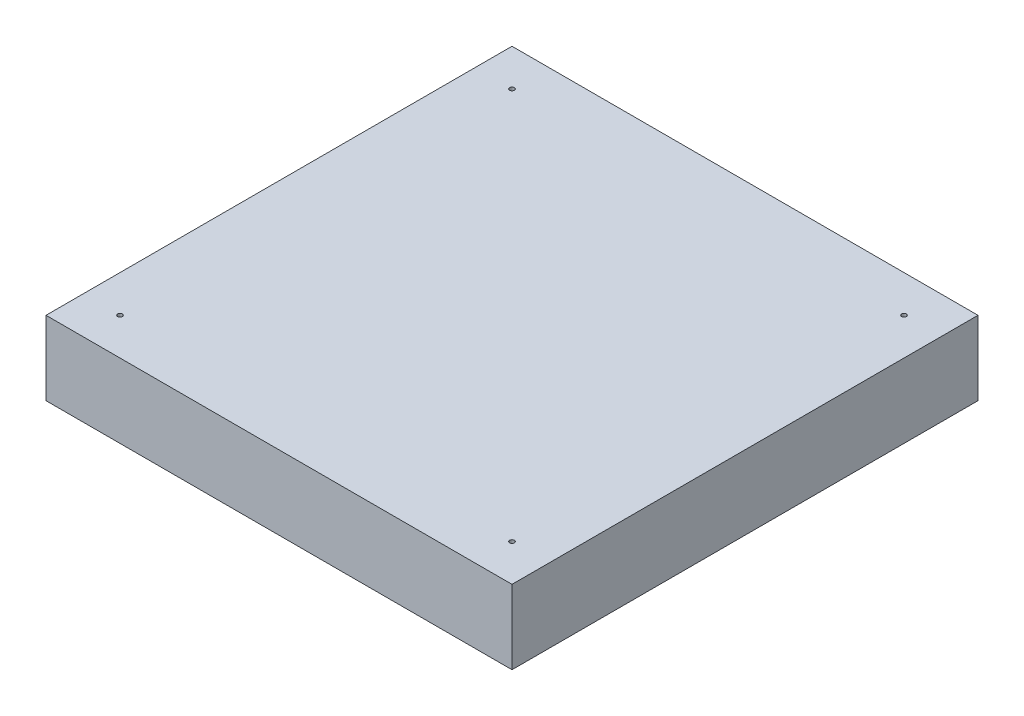
ISO-10303-21;
HEADER;
FILE_DESCRIPTION(('STEP AP214'),'2;1');
FILE_NAME('part.step','',(''),(''),'','','');
FILE_SCHEMA(('AUTOMOTIVE_DESIGN { 1 0 10303 214 1 1 1 1 }'));
ENDSEC;
DATA;
#1=APPLICATION_CONTEXT('core data for automotive mechanical design processes');
#2=APPLICATION_PROTOCOL_DEFINITION('international standard','automotive_design',2000,#1);
#3=PRODUCT_CONTEXT('',#1,'mechanical');
#4=PRODUCT('Part','Part','',(#3));
#5=PRODUCT_RELATED_PRODUCT_CATEGORY('part','',(#4));
#6=PRODUCT_DEFINITION_FORMATION('','',#4);
#7=PRODUCT_DEFINITION_CONTEXT('part definition',#1,'design');
#8=PRODUCT_DEFINITION('design','',#6,#7);
#9=PRODUCT_DEFINITION_SHAPE('','',#8);
#10=(LENGTH_UNIT() NAMED_UNIT(*) SI_UNIT(.MILLI.,.METRE.));
#11=(NAMED_UNIT(*) PLANE_ANGLE_UNIT() SI_UNIT($,.RADIAN.));
#12=(NAMED_UNIT(*) SI_UNIT($,.STERADIAN.) SOLID_ANGLE_UNIT());
#13=UNCERTAINTY_MEASURE_WITH_UNIT(LENGTH_MEASURE(1.E-05),#10,'distance_accuracy_value','');
#14=(GEOMETRIC_REPRESENTATION_CONTEXT(3) GLOBAL_UNCERTAINTY_ASSIGNED_CONTEXT((#13)) GLOBAL_UNIT_ASSIGNED_CONTEXT((#10,
#11,#12)) REPRESENTATION_CONTEXT('',''));
#15=CARTESIAN_POINT('',(0.,0.,0.));
#16=DIRECTION('',(0.,0.,1.));
#17=DIRECTION('',(1.,0.,0.));
#18=AXIS2_PLACEMENT_3D('',#15,#16,#17);
#19=CARTESIAN_POINT('',(80.,25.4,80.));
#20=DIRECTION('',(-1.,0.,0.));
#21=DIRECTION('',(0.,0.,1.));
#22=AXIS2_PLACEMENT_3D('',#19,#20,#21);
#23=PLANE('',#22);
#24=DIRECTION('',(0.,0.,-1.));
#25=VECTOR('',#24,1.);
#26=CARTESIAN_POINT('',(80.,0.,80.));
#27=LINE('',#26,#25);
#28=CARTESIAN_POINT('',(80.,0.,80.));
#29=VERTEX_POINT('',#28);
#30=CARTESIAN_POINT('',(80.,0.,-80.));
#31=VERTEX_POINT('',#30);
#32=EDGE_CURVE('E96',#29,#31,#27,.T.);
#33=ORIENTED_EDGE('',*,*,#32,.T.);
#34=DIRECTION('',(0.,-1.,0.));
#35=VECTOR('',#34,1.);
#36=CARTESIAN_POINT('',(80.,25.4,-80.));
#37=LINE('',#36,#35);
#38=CARTESIAN_POINT('',(80.,25.4,-80.));
#39=VERTEX_POINT('',#38);
#40=EDGE_CURVE('E11',#39,#31,#37,.T.);
#41=ORIENTED_EDGE('',*,*,#40,.F.);
#42=DIRECTION('',(0.,0.,-1.));
#43=VECTOR('',#42,1.);
#44=CARTESIAN_POINT('',(80.,25.4,80.));
#45=LINE('',#44,#43);
#46=CARTESIAN_POINT('',(80.,25.4,80.));
#47=VERTEX_POINT('',#46);
#48=EDGE_CURVE('E84',#47,#39,#45,.T.);
#49=ORIENTED_EDGE('',*,*,#48,.F.);
#50=DIRECTION('',(0.,-1.,0.));
#51=VECTOR('',#50,1.);
#52=CARTESIAN_POINT('',(80.,25.4,80.));
#53=LINE('',#52,#51);
#54=EDGE_CURVE('E92',#47,#29,#53,.T.);
#55=ORIENTED_EDGE('',*,*,#54,.T.);
#56=EDGE_LOOP('',(#33,#41,#49,#55));
#57=FACE_BOUND('',#56,.T.);
#58=ADVANCED_FACE('F33',(#57),#23,.F.);
#59=CARTESIAN_POINT('',(-80.,25.4,-80.));
#60=DIRECTION('',(0.,0.,1.));
#61=DIRECTION('',(1.,0.,0.));
#62=AXIS2_PLACEMENT_3D('',#59,#60,#61);
#63=PLANE('',#62);
#64=DIRECTION('',(-1.,0.,0.));
#65=VECTOR('',#64,1.);
#66=CARTESIAN_POINT('',(-80.,0.,-80.));
#67=LINE('',#66,#65);
#68=CARTESIAN_POINT('',(-80.,0.,-80.));
#69=VERTEX_POINT('',#68);
#70=EDGE_CURVE('E88',#31,#69,#67,.T.);
#71=ORIENTED_EDGE('',*,*,#70,.T.);
#72=DIRECTION('',(0.,-1.,0.));
#73=VECTOR('',#72,1.);
#74=CARTESIAN_POINT('',(-80.,25.4,-80.));
#75=LINE('',#74,#73);
#76=CARTESIAN_POINT('',(-80.,25.4,-80.));
#77=VERTEX_POINT('',#76);
#78=EDGE_CURVE('E41',#77,#69,#75,.T.);
#79=ORIENTED_EDGE('',*,*,#78,.F.);
#80=DIRECTION('',(-1.,0.,0.));
#81=VECTOR('',#80,1.);
#82=CARTESIAN_POINT('',(-80.,25.4,-80.));
#83=LINE('',#82,#81);
#84=EDGE_CURVE('E79',#39,#77,#83,.T.);
#85=ORIENTED_EDGE('',*,*,#84,.F.);
#86=ORIENTED_EDGE('',*,*,#40,.T.);
#87=EDGE_LOOP('',(#71,#79,#85,#86));
#88=FACE_BOUND('',#87,.T.);
#89=ADVANCED_FACE('F87',(#88),#63,.F.);
#90=CARTESIAN_POINT('',(-80.,25.4,80.));
#91=DIRECTION('',(1.,0.,0.));
#92=DIRECTION('',(0.,0.,-1.));
#93=AXIS2_PLACEMENT_3D('',#90,#91,#92);
#94=PLANE('',#93);
#95=DIRECTION('',(0.,0.,1.));
#96=VECTOR('',#95,1.);
#97=CARTESIAN_POINT('',(-80.,0.,80.));
#98=LINE('',#97,#96);
#99=CARTESIAN_POINT('',(-80.,0.,80.));
#100=VERTEX_POINT('',#99);
#101=EDGE_CURVE('E66',#69,#100,#98,.T.);
#102=ORIENTED_EDGE('',*,*,#101,.T.);
#103=DIRECTION('',(0.,-1.,0.));
#104=VECTOR('',#103,1.);
#105=CARTESIAN_POINT('',(-80.,25.4,80.));
#106=LINE('',#105,#104);
#107=CARTESIAN_POINT('',(-80.,25.4,80.));
#108=VERTEX_POINT('',#107);
#109=EDGE_CURVE('E89',#108,#100,#106,.T.);
#110=ORIENTED_EDGE('',*,*,#109,.F.);
#111=DIRECTION('',(0.,0.,1.));
#112=VECTOR('',#111,1.);
#113=CARTESIAN_POINT('',(-80.,25.4,80.));
#114=LINE('',#113,#112);
#115=EDGE_CURVE('E82',#77,#108,#114,.T.);
#116=ORIENTED_EDGE('',*,*,#115,.F.);
#117=ORIENTED_EDGE('',*,*,#78,.T.);
#118=EDGE_LOOP('',(#102,#110,#116,#117));
#119=FACE_BOUND('',#118,.T.);
#120=ADVANCED_FACE('F90',(#119),#94,.F.);
#121=CARTESIAN_POINT('',(-80.,25.4,80.));
#122=DIRECTION('',(0.,0.,-1.));
#123=DIRECTION('',(-1.,0.,0.));
#124=AXIS2_PLACEMENT_3D('',#121,#122,#123);
#125=PLANE('',#124);
#126=DIRECTION('',(1.,0.,0.));
#127=VECTOR('',#126,1.);
#128=CARTESIAN_POINT('',(-80.,0.,80.));
#129=LINE('',#128,#127);
#130=EDGE_CURVE('E72',#100,#29,#129,.T.);
#131=ORIENTED_EDGE('',*,*,#130,.T.);
#132=ORIENTED_EDGE('',*,*,#54,.F.);
#133=DIRECTION('',(1.,0.,0.));
#134=VECTOR('',#133,1.);
#135=CARTESIAN_POINT('',(-80.,25.4,80.));
#136=LINE('',#135,#134);
#137=EDGE_CURVE('E49',#108,#47,#136,.T.);
#138=ORIENTED_EDGE('',*,*,#137,.F.);
#139=ORIENTED_EDGE('',*,*,#109,.T.);
#140=EDGE_LOOP('',(#131,#132,#138,#139));
#141=FACE_BOUND('',#140,.T.);
#142=ADVANCED_FACE('F104',(#141),#125,.F.);
#143=CARTESIAN_POINT('',(0.,25.4,0.));
#144=DIRECTION('',(0.,-1.,0.));
#145=DIRECTION('',(0.,0.,-1.));
#146=AXIS2_PLACEMENT_3D('',#143,#144,#145);
#147=PLANE('',#146);
#148=CARTESIAN_POINT('',(-67.3,25.4,-67.3));
#149=DIRECTION('',(0.,-1.,0.));
#150=DIRECTION('',(0.,0.,-1.));
#151=AXIS2_PLACEMENT_3D('',#148,#149,#150);
#152=CIRCLE('',#151,0.80645);
#153=CARTESIAN_POINT('',(-67.3,25.4,-68.10645));
#154=VERTEX_POINT('',#153);
#155=EDGE_CURVE('E154',#154,#154,#152,.T.);
#156=ORIENTED_EDGE('',*,*,#155,.T.);
#157=EDGE_LOOP('',(#156));
#158=FACE_BOUND('',#157,.T.);
#159=CARTESIAN_POINT('',(67.3,25.4,-67.3));
#160=DIRECTION('',(0.,-1.,0.));
#161=DIRECTION('',(0.,0.,-1.));
#162=AXIS2_PLACEMENT_3D('',#159,#160,#161);
#163=CIRCLE('',#162,0.80645);
#164=CARTESIAN_POINT('',(67.3,25.4,-68.10645));
#165=VERTEX_POINT('',#164);
#166=EDGE_CURVE('E139',#165,#165,#163,.T.);
#167=ORIENTED_EDGE('',*,*,#166,.T.);
#168=EDGE_LOOP('',(#167));
#169=FACE_BOUND('',#168,.T.);
#170=CARTESIAN_POINT('',(67.3,25.4,67.3));
#171=DIRECTION('',(0.,-1.,0.));
#172=DIRECTION('',(0.,0.,-1.));
#173=AXIS2_PLACEMENT_3D('',#170,#171,#172);
#174=CIRCLE('',#173,0.80645);
#175=CARTESIAN_POINT('',(67.3,25.4,66.49355));
#176=VERTEX_POINT('',#175);
#177=EDGE_CURVE('E124',#176,#176,#174,.T.);
#178=ORIENTED_EDGE('',*,*,#177,.T.);
#179=EDGE_LOOP('',(#178));
#180=FACE_BOUND('',#179,.T.);
#181=CARTESIAN_POINT('',(-67.3,25.4,67.3));
#182=DIRECTION('',(0.,-1.,0.));
#183=DIRECTION('',(0.,0.,-1.));
#184=AXIS2_PLACEMENT_3D('',#181,#182,#183);
#185=CIRCLE('',#184,0.80645);
#186=CARTESIAN_POINT('',(-67.3,25.4,66.49355));
#187=VERTEX_POINT('',#186);
#188=EDGE_CURVE('E99',#187,#187,#185,.T.);
#189=ORIENTED_EDGE('',*,*,#188,.T.);
#190=EDGE_LOOP('',(#189));
#191=FACE_BOUND('',#190,.T.);
#192=ORIENTED_EDGE('',*,*,#48,.T.);
#193=ORIENTED_EDGE('',*,*,#84,.T.);
#194=ORIENTED_EDGE('',*,*,#115,.T.);
#195=ORIENTED_EDGE('',*,*,#137,.T.);
#196=EDGE_LOOP('',(#192,#193,#194,#195));
#197=FACE_BOUND('',#196,.T.);
#198=ADVANCED_FACE('F80',(#158,#169,#180,#191,#197),#147,.F.);
#199=CARTESIAN_POINT('',(0.,0.,0.));
#200=DIRECTION('',(0.,-1.,0.));
#201=DIRECTION('',(0.,0.,-1.));
#202=AXIS2_PLACEMENT_3D('',#199,#200,#201);
#203=PLANE('',#202);
#204=CARTESIAN_POINT('',(-67.3,0.,-67.3));
#205=DIRECTION('',(0.,-1.,0.));
#206=DIRECTION('',(0.,0.,-1.));
#207=AXIS2_PLACEMENT_3D('',#204,#205,#206);
#208=CIRCLE('',#207,2.8575);
#209=CARTESIAN_POINT('',(-67.3,0.,-70.1575));
#210=VERTEX_POINT('',#209);
#211=EDGE_CURVE('E166',#210,#210,#208,.T.);
#212=ORIENTED_EDGE('',*,*,#211,.F.);
#213=EDGE_LOOP('',(#212));
#214=FACE_BOUND('',#213,.T.);
#215=CARTESIAN_POINT('',(67.3,0.,-67.3));
#216=DIRECTION('',(0.,-1.,0.));
#217=DIRECTION('',(0.,0.,-1.));
#218=AXIS2_PLACEMENT_3D('',#215,#216,#217);
#219=CIRCLE('',#218,2.8575);
#220=CARTESIAN_POINT('',(67.3,0.,-70.1575));
#221=VERTEX_POINT('',#220);
#222=EDGE_CURVE('E151',#221,#221,#219,.T.);
#223=ORIENTED_EDGE('',*,*,#222,.F.);
#224=EDGE_LOOP('',(#223));
#225=FACE_BOUND('',#224,.T.);
#226=CARTESIAN_POINT('',(67.3,0.,67.3));
#227=DIRECTION('',(0.,-1.,0.));
#228=DIRECTION('',(0.,0.,-1.));
#229=AXIS2_PLACEMENT_3D('',#226,#227,#228);
#230=CIRCLE('',#229,2.8575);
#231=CARTESIAN_POINT('',(67.3,0.,64.4425));
#232=VERTEX_POINT('',#231);
#233=EDGE_CURVE('E136',#232,#232,#230,.T.);
#234=ORIENTED_EDGE('',*,*,#233,.F.);
#235=EDGE_LOOP('',(#234));
#236=FACE_BOUND('',#235,.T.);
#237=CARTESIAN_POINT('',(-67.3,0.,67.3));
#238=DIRECTION('',(0.,-1.,0.));
#239=DIRECTION('',(0.,0.,-1.));
#240=AXIS2_PLACEMENT_3D('',#237,#238,#239);
#241=CIRCLE('',#240,2.8575);
#242=CARTESIAN_POINT('',(-67.3,0.,64.4425));
#243=VERTEX_POINT('',#242);
#244=EDGE_CURVE('E121',#243,#243,#241,.T.);
#245=ORIENTED_EDGE('',*,*,#244,.F.);
#246=EDGE_LOOP('',(#245));
#247=FACE_BOUND('',#246,.T.);
#248=ORIENTED_EDGE('',*,*,#32,.F.);
#249=ORIENTED_EDGE('',*,*,#130,.F.);
#250=ORIENTED_EDGE('',*,*,#101,.F.);
#251=ORIENTED_EDGE('',*,*,#70,.F.);
#252=EDGE_LOOP('',(#248,#249,#250,#251));
#253=FACE_BOUND('',#252,.T.);
#254=ADVANCED_FACE('F107',(#214,#225,#236,#247,#253),#203,.T.);
#255=CARTESIAN_POINT('',(-67.3,0.,67.3));
#256=DIRECTION('',(0.,-1.,0.));
#257=DIRECTION('',(0.,0.,-1.));
#258=AXIS2_PLACEMENT_3D('',#255,#256,#257);
#259=CYLINDRICAL_SURFACE('',#258,0.80645);
#260=ORIENTED_EDGE('',*,*,#188,.F.);
#261=EDGE_LOOP('',(#260));
#262=FACE_BOUND('',#261,.T.);
#263=CARTESIAN_POINT('',(-67.3,0.8128,67.3));
#264=DIRECTION('',(0.,-1.,0.));
#265=DIRECTION('',(0.,0.,-1.));
#266=AXIS2_PLACEMENT_3D('',#263,#264,#265);
#267=CIRCLE('',#266,0.80645);
#268=CARTESIAN_POINT('',(-67.3,0.8128,66.49355));
#269=VERTEX_POINT('',#268);
#270=EDGE_CURVE('E112',#269,#269,#267,.T.);
#271=ORIENTED_EDGE('',*,*,#270,.T.);
#272=EDGE_LOOP('',(#271));
#273=FACE_BOUND('',#272,.T.);
#274=ADVANCED_FACE('F174',(#262,#273),#259,.F.);
#275=CARTESIAN_POINT('',(-65.31499,0.8128,67.3));
#276=DIRECTION('',(0.,1.,0.));
#277=DIRECTION('',(0.,0.,1.));
#278=AXIS2_PLACEMENT_3D('',#275,#276,#277);
#279=PLANE('',#278);
#280=ORIENTED_EDGE('',*,*,#270,.F.);
#281=EDGE_LOOP('',(#280));
#282=FACE_BOUND('',#281,.T.);
#283=CARTESIAN_POINT('',(-67.3,0.8128,67.3));
#284=DIRECTION('',(0.,-1.,0.));
#285=DIRECTION('',(0.,0.,-1.));
#286=AXIS2_PLACEMENT_3D('',#283,#284,#285);
#287=CIRCLE('',#286,1.98501);
#288=CARTESIAN_POINT('',(-67.3,0.8128,65.31499));
#289=VERTEX_POINT('',#288);
#290=EDGE_CURVE('E115',#289,#289,#287,.T.);
#291=ORIENTED_EDGE('',*,*,#290,.T.);
#292=EDGE_LOOP('',(#291));
#293=FACE_BOUND('',#292,.T.);
#294=ADVANCED_FACE('F195',(#282,#293),#279,.F.);
#295=CARTESIAN_POINT('',(-67.3,0.,67.3));
#296=DIRECTION('',(0.,-1.,0.));
#297=DIRECTION('',(0.,0.,-1.));
#298=AXIS2_PLACEMENT_3D('',#295,#296,#297);
#299=CYLINDRICAL_SURFACE('',#298,1.98501);
#300=ORIENTED_EDGE('',*,*,#290,.F.);
#301=EDGE_LOOP('',(#300));
#302=FACE_BOUND('',#301,.T.);
#303=CARTESIAN_POINT('',(-67.3,0.87249,67.3));
#304=DIRECTION('',(0.,-1.,0.));
#305=DIRECTION('',(0.,0.,-1.));
#306=AXIS2_PLACEMENT_3D('',#303,#304,#305);
#307=CIRCLE('',#306,1.98501);
#308=CARTESIAN_POINT('',(-67.3,0.87249,65.31499));
#309=VERTEX_POINT('',#308);
#310=EDGE_CURVE('E118',#309,#309,#307,.T.);
#311=ORIENTED_EDGE('',*,*,#310,.T.);
#312=EDGE_LOOP('',(#311));
#313=FACE_BOUND('',#312,.T.);
#314=ADVANCED_FACE('F185',(#302,#313),#299,.T.);
#315=CARTESIAN_POINT('',(-67.3,0.,67.3));
#316=DIRECTION('',(0.,-1.,0.));
#317=DIRECTION('',(0.,0.,-1.));
#318=AXIS2_PLACEMENT_3D('',#315,#316,#317);
#319=CONICAL_SURFACE('',#318,2.8575,0.78539816339745);
#320=ORIENTED_EDGE('',*,*,#310,.F.);
#321=EDGE_LOOP('',(#320));
#322=FACE_BOUND('',#321,.T.);
#323=ORIENTED_EDGE('',*,*,#244,.T.);
#324=EDGE_LOOP('',(#323));
#325=FACE_BOUND('',#324,.T.);
#326=ADVANCED_FACE('F182',(#322,#325),#319,.F.);
#327=CARTESIAN_POINT('',(67.3,0.,67.3));
#328=DIRECTION('',(0.,-1.,0.));
#329=DIRECTION('',(0.,0.,-1.));
#330=AXIS2_PLACEMENT_3D('',#327,#328,#329);
#331=CYLINDRICAL_SURFACE('',#330,0.80645);
#332=ORIENTED_EDGE('',*,*,#177,.F.);
#333=EDGE_LOOP('',(#332));
#334=FACE_BOUND('',#333,.T.);
#335=CARTESIAN_POINT('',(67.3,0.8128,67.3));
#336=DIRECTION('',(0.,-1.,0.));
#337=DIRECTION('',(0.,0.,-1.));
#338=AXIS2_PLACEMENT_3D('',#335,#336,#337);
#339=CIRCLE('',#338,0.80645);
#340=CARTESIAN_POINT('',(67.3,0.8128,66.49355));
#341=VERTEX_POINT('',#340);
#342=EDGE_CURVE('E127',#341,#341,#339,.T.);
#343=ORIENTED_EDGE('',*,*,#342,.T.);
#344=EDGE_LOOP('',(#343));
#345=FACE_BOUND('',#344,.T.);
#346=ADVANCED_FACE('F184',(#334,#345),#331,.F.);
#347=CARTESIAN_POINT('',(69.28501,0.8128,67.3));
#348=DIRECTION('',(0.,1.,0.));
#349=DIRECTION('',(0.,0.,1.));
#350=AXIS2_PLACEMENT_3D('',#347,#348,#349);
#351=PLANE('',#350);
#352=ORIENTED_EDGE('',*,*,#342,.F.);
#353=EDGE_LOOP('',(#352));
#354=FACE_BOUND('',#353,.T.);
#355=CARTESIAN_POINT('',(67.3,0.8128,67.3));
#356=DIRECTION('',(0.,-1.,0.));
#357=DIRECTION('',(0.,0.,-1.));
#358=AXIS2_PLACEMENT_3D('',#355,#356,#357);
#359=CIRCLE('',#358,1.98501);
#360=CARTESIAN_POINT('',(67.3,0.8128,65.31499));
#361=VERTEX_POINT('',#360);
#362=EDGE_CURVE('E130',#361,#361,#359,.T.);
#363=ORIENTED_EDGE('',*,*,#362,.T.);
#364=EDGE_LOOP('',(#363));
#365=FACE_BOUND('',#364,.T.);
#366=ADVANCED_FACE('F192',(#354,#365),#351,.F.);
#367=CARTESIAN_POINT('',(67.3,0.,67.3));
#368=DIRECTION('',(0.,-1.,0.));
#369=DIRECTION('',(0.,0.,-1.));
#370=AXIS2_PLACEMENT_3D('',#367,#368,#369);
#371=CYLINDRICAL_SURFACE('',#370,1.98501);
#372=ORIENTED_EDGE('',*,*,#362,.F.);
#373=EDGE_LOOP('',(#372));
#374=FACE_BOUND('',#373,.T.);
#375=CARTESIAN_POINT('',(67.3,0.87249,67.3));
#376=DIRECTION('',(0.,-1.,0.));
#377=DIRECTION('',(0.,0.,-1.));
#378=AXIS2_PLACEMENT_3D('',#375,#376,#377);
#379=CIRCLE('',#378,1.98501);
#380=CARTESIAN_POINT('',(67.3,0.87249,65.31499));
#381=VERTEX_POINT('',#380);
#382=EDGE_CURVE('E133',#381,#381,#379,.T.);
#383=ORIENTED_EDGE('',*,*,#382,.T.);
#384=EDGE_LOOP('',(#383));
#385=FACE_BOUND('',#384,.T.);
#386=ADVANCED_FACE('F250',(#374,#385),#371,.T.);
#387=CARTESIAN_POINT('',(67.3,0.,67.3));
#388=DIRECTION('',(0.,-1.,0.));
#389=DIRECTION('',(0.,0.,-1.));
#390=AXIS2_PLACEMENT_3D('',#387,#388,#389);
#391=CONICAL_SURFACE('',#390,2.8575,0.78539816339745);
#392=ORIENTED_EDGE('',*,*,#382,.F.);
#393=EDGE_LOOP('',(#392));
#394=FACE_BOUND('',#393,.T.);
#395=ORIENTED_EDGE('',*,*,#233,.T.);
#396=EDGE_LOOP('',(#395));
#397=FACE_BOUND('',#396,.T.);
#398=ADVANCED_FACE('F260',(#394,#397),#391,.F.);
#399=CARTESIAN_POINT('',(67.3,0.,-67.3));
#400=DIRECTION('',(0.,-1.,0.));
#401=DIRECTION('',(0.,0.,-1.));
#402=AXIS2_PLACEMENT_3D('',#399,#400,#401);
#403=CYLINDRICAL_SURFACE('',#402,0.80645);
#404=ORIENTED_EDGE('',*,*,#166,.F.);
#405=EDGE_LOOP('',(#404));
#406=FACE_BOUND('',#405,.T.);
#407=CARTESIAN_POINT('',(67.3,0.8128,-67.3));
#408=DIRECTION('',(0.,-1.,0.));
#409=DIRECTION('',(0.,0.,-1.));
#410=AXIS2_PLACEMENT_3D('',#407,#408,#409);
#411=CIRCLE('',#410,0.80645);
#412=CARTESIAN_POINT('',(67.3,0.8128,-68.10645));
#413=VERTEX_POINT('',#412);
#414=EDGE_CURVE('E142',#413,#413,#411,.T.);
#415=ORIENTED_EDGE('',*,*,#414,.T.);
#416=EDGE_LOOP('',(#415));
#417=FACE_BOUND('',#416,.T.);
#418=ADVANCED_FACE('F270',(#406,#417),#403,.F.);
#419=CARTESIAN_POINT('',(69.28501,0.8128,-67.3));
#420=DIRECTION('',(0.,1.,0.));
#421=DIRECTION('',(0.,0.,1.));
#422=AXIS2_PLACEMENT_3D('',#419,#420,#421);
#423=PLANE('',#422);
#424=ORIENTED_EDGE('',*,*,#414,.F.);
#425=EDGE_LOOP('',(#424));
#426=FACE_BOUND('',#425,.T.);
#427=CARTESIAN_POINT('',(67.3,0.8128,-67.3));
#428=DIRECTION('',(0.,-1.,0.));
#429=DIRECTION('',(0.,0.,-1.));
#430=AXIS2_PLACEMENT_3D('',#427,#428,#429);
#431=CIRCLE('',#430,1.98501);
#432=CARTESIAN_POINT('',(67.3,0.8128,-69.28501));
#433=VERTEX_POINT('',#432);
#434=EDGE_CURVE('E145',#433,#433,#431,.T.);
#435=ORIENTED_EDGE('',*,*,#434,.T.);
#436=EDGE_LOOP('',(#435));
#437=FACE_BOUND('',#436,.T.);
#438=ADVANCED_FACE('F280',(#426,#437),#423,.F.);
#439=CARTESIAN_POINT('',(67.3,0.,-67.3));
#440=DIRECTION('',(0.,-1.,0.));
#441=DIRECTION('',(0.,0.,-1.));
#442=AXIS2_PLACEMENT_3D('',#439,#440,#441);
#443=CYLINDRICAL_SURFACE('',#442,1.98501);
#444=ORIENTED_EDGE('',*,*,#434,.F.);
#445=EDGE_LOOP('',(#444));
#446=FACE_BOUND('',#445,.T.);
#447=CARTESIAN_POINT('',(67.3,0.87249,-67.3));
#448=DIRECTION('',(0.,-1.,0.));
#449=DIRECTION('',(0.,0.,-1.));
#450=AXIS2_PLACEMENT_3D('',#447,#448,#449);
#451=CIRCLE('',#450,1.98501);
#452=CARTESIAN_POINT('',(67.3,0.87249,-69.28501));
#453=VERTEX_POINT('',#452);
#454=EDGE_CURVE('E148',#453,#453,#451,.T.);
#455=ORIENTED_EDGE('',*,*,#454,.T.);
#456=EDGE_LOOP('',(#455));
#457=FACE_BOUND('',#456,.T.);
#458=ADVANCED_FACE('F290',(#446,#457),#443,.T.);
#459=CARTESIAN_POINT('',(67.3,0.,-67.3));
#460=DIRECTION('',(0.,-1.,0.));
#461=DIRECTION('',(0.,0.,-1.));
#462=AXIS2_PLACEMENT_3D('',#459,#460,#461);
#463=CONICAL_SURFACE('',#462,2.8575,0.78539816339745);
#464=ORIENTED_EDGE('',*,*,#454,.F.);
#465=EDGE_LOOP('',(#464));
#466=FACE_BOUND('',#465,.T.);
#467=ORIENTED_EDGE('',*,*,#222,.T.);
#468=EDGE_LOOP('',(#467));
#469=FACE_BOUND('',#468,.T.);
#470=ADVANCED_FACE('F300',(#466,#469),#463,.F.);
#471=CARTESIAN_POINT('',(-67.3,0.,-67.3));
#472=DIRECTION('',(0.,-1.,0.));
#473=DIRECTION('',(0.,0.,-1.));
#474=AXIS2_PLACEMENT_3D('',#471,#472,#473);
#475=CYLINDRICAL_SURFACE('',#474,0.80645);
#476=ORIENTED_EDGE('',*,*,#155,.F.);
#477=EDGE_LOOP('',(#476));
#478=FACE_BOUND('',#477,.T.);
#479=CARTESIAN_POINT('',(-67.3,0.8128,-67.3));
#480=DIRECTION('',(0.,-1.,0.));
#481=DIRECTION('',(0.,0.,-1.));
#482=AXIS2_PLACEMENT_3D('',#479,#480,#481);
#483=CIRCLE('',#482,0.80645);
#484=CARTESIAN_POINT('',(-67.3,0.8128,-68.10645));
#485=VERTEX_POINT('',#484);
#486=EDGE_CURVE('E157',#485,#485,#483,.T.);
#487=ORIENTED_EDGE('',*,*,#486,.T.);
#488=EDGE_LOOP('',(#487));
#489=FACE_BOUND('',#488,.T.);
#490=ADVANCED_FACE('F310',(#478,#489),#475,.F.);
#491=CARTESIAN_POINT('',(-65.31499,0.8128,-67.3));
#492=DIRECTION('',(0.,1.,0.));
#493=DIRECTION('',(0.,0.,1.));
#494=AXIS2_PLACEMENT_3D('',#491,#492,#493);
#495=PLANE('',#494);
#496=ORIENTED_EDGE('',*,*,#486,.F.);
#497=EDGE_LOOP('',(#496));
#498=FACE_BOUND('',#497,.T.);
#499=CARTESIAN_POINT('',(-67.3,0.8128,-67.3));
#500=DIRECTION('',(0.,-1.,0.));
#501=DIRECTION('',(0.,0.,-1.));
#502=AXIS2_PLACEMENT_3D('',#499,#500,#501);
#503=CIRCLE('',#502,1.98501);
#504=CARTESIAN_POINT('',(-67.3,0.8128,-69.28501));
#505=VERTEX_POINT('',#504);
#506=EDGE_CURVE('E160',#505,#505,#503,.T.);
#507=ORIENTED_EDGE('',*,*,#506,.T.);
#508=EDGE_LOOP('',(#507));
#509=FACE_BOUND('',#508,.T.);
#510=ADVANCED_FACE('F320',(#498,#509),#495,.F.);
#511=CARTESIAN_POINT('',(-67.3,0.,-67.3));
#512=DIRECTION('',(0.,-1.,0.));
#513=DIRECTION('',(0.,0.,-1.));
#514=AXIS2_PLACEMENT_3D('',#511,#512,#513);
#515=CYLINDRICAL_SURFACE('',#514,1.98501);
#516=ORIENTED_EDGE('',*,*,#506,.F.);
#517=EDGE_LOOP('',(#516));
#518=FACE_BOUND('',#517,.T.);
#519=CARTESIAN_POINT('',(-67.3,0.87249,-67.3));
#520=DIRECTION('',(0.,-1.,0.));
#521=DIRECTION('',(0.,0.,-1.));
#522=AXIS2_PLACEMENT_3D('',#519,#520,#521);
#523=CIRCLE('',#522,1.98501);
#524=CARTESIAN_POINT('',(-67.3,0.87249,-69.28501));
#525=VERTEX_POINT('',#524);
#526=EDGE_CURVE('E163',#525,#525,#523,.T.);
#527=ORIENTED_EDGE('',*,*,#526,.T.);
#528=EDGE_LOOP('',(#527));
#529=FACE_BOUND('',#528,.T.);
#530=ADVANCED_FACE('F330',(#518,#529),#515,.T.);
#531=CARTESIAN_POINT('',(-67.3,0.,-67.3));
#532=DIRECTION('',(0.,-1.,0.));
#533=DIRECTION('',(0.,0.,-1.));
#534=AXIS2_PLACEMENT_3D('',#531,#532,#533);
#535=CONICAL_SURFACE('',#534,2.8575,0.78539816339745);
#536=ORIENTED_EDGE('',*,*,#526,.F.);
#537=EDGE_LOOP('',(#536));
#538=FACE_BOUND('',#537,.T.);
#539=ORIENTED_EDGE('',*,*,#211,.T.);
#540=EDGE_LOOP('',(#539));
#541=FACE_BOUND('',#540,.T.);
#542=ADVANCED_FACE('F170',(#538,#541),#535,.F.);
#543=CLOSED_SHELL('',(#58,#89,#120,#142,#198,#254,#274,#294,#314,#326,#346,#366,#386,#398,#418,
#438,#458,#470,#490,#510,#530,#542));
#544=MANIFOLD_SOLID_BREP('B2',#543);
#545=ADVANCED_BREP_SHAPE_REPRESENTATION('',(#18,#544),#14);
#546=SHAPE_DEFINITION_REPRESENTATION(#9,#545);
ENDSEC;
END-ISO-10303-21;
